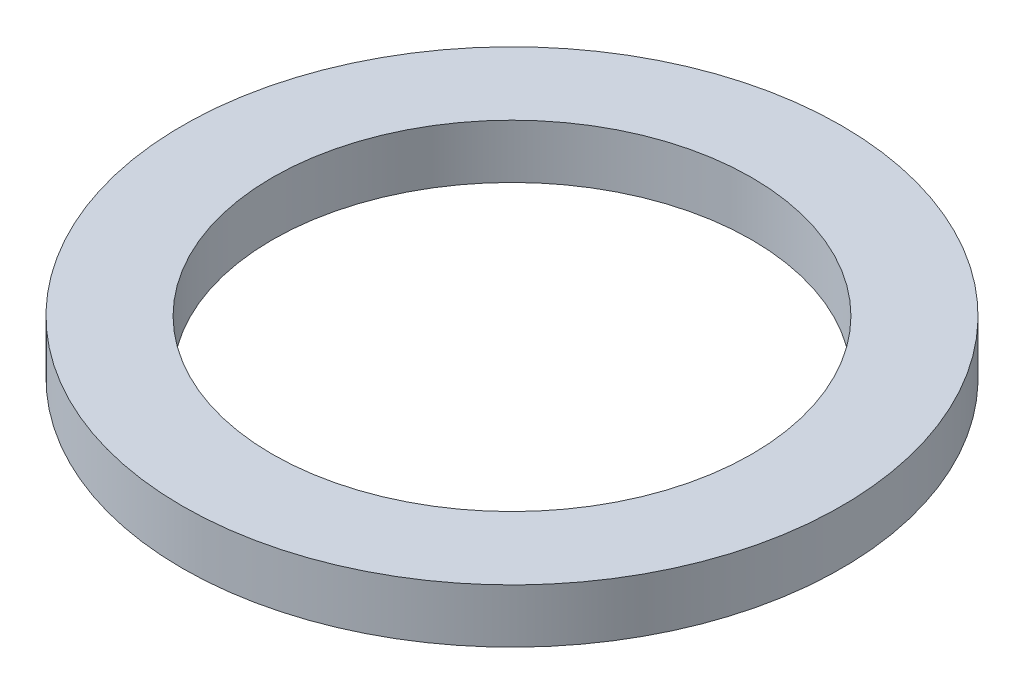
ISO-10303-21;
HEADER;
FILE_DESCRIPTION(('STEP AP214'),'2;1');
FILE_NAME('part.step','',(''),(''),'','','');
FILE_SCHEMA(('AUTOMOTIVE_DESIGN { 1 0 10303 214 1 1 1 1 }'));
ENDSEC;
DATA;
#1=APPLICATION_CONTEXT('core data for automotive mechanical design processes');
#2=APPLICATION_PROTOCOL_DEFINITION('international standard','automotive_design',2000,#1);
#3=PRODUCT_CONTEXT('',#1,'mechanical');
#4=PRODUCT('Part','Part','',(#3));
#5=PRODUCT_RELATED_PRODUCT_CATEGORY('part','',(#4));
#6=PRODUCT_DEFINITION_FORMATION('','',#4);
#7=PRODUCT_DEFINITION_CONTEXT('part definition',#1,'design');
#8=PRODUCT_DEFINITION('design','',#6,#7);
#9=PRODUCT_DEFINITION_SHAPE('','',#8);
#10=(LENGTH_UNIT() NAMED_UNIT(*) SI_UNIT(.MILLI.,.METRE.));
#11=(NAMED_UNIT(*) PLANE_ANGLE_UNIT() SI_UNIT($,.RADIAN.));
#12=(NAMED_UNIT(*) SI_UNIT($,.STERADIAN.) SOLID_ANGLE_UNIT());
#13=UNCERTAINTY_MEASURE_WITH_UNIT(LENGTH_MEASURE(1.E-05),#10,'distance_accuracy_value','');
#14=(GEOMETRIC_REPRESENTATION_CONTEXT(3) GLOBAL_UNCERTAINTY_ASSIGNED_CONTEXT((#13)) GLOBAL_UNIT_ASSIGNED_CONTEXT((#10,
#11,#12)) REPRESENTATION_CONTEXT('',''));
#15=CARTESIAN_POINT('',(0.,0.,0.));
#16=DIRECTION('',(0.,0.,1.));
#17=DIRECTION('',(1.,0.,0.));
#18=AXIS2_PLACEMENT_3D('',#15,#16,#17);
#19=CARTESIAN_POINT('',(0.,9.,0.));
#20=DIRECTION('',(0.,-1.,0.));
#21=DIRECTION('',(0.,0.,-1.));
#22=AXIS2_PLACEMENT_3D('',#19,#20,#21);
#23=CYLINDRICAL_SURFACE('',#22,55.);
#24=CARTESIAN_POINT('',(0.,9.,0.));
#25=DIRECTION('',(0.,1.,0.));
#26=DIRECTION('',(0.,0.,1.));
#27=AXIS2_PLACEMENT_3D('',#24,#25,#26);
#28=CIRCLE('',#27,55.);
#29=CARTESIAN_POINT('',(0.,9.,55.));
#30=VERTEX_POINT('',#29);
#31=EDGE_CURVE('E10',#30,#30,#28,.T.);
#32=ORIENTED_EDGE('',*,*,#31,.F.);
#33=EDGE_LOOP('',(#32));
#34=FACE_BOUND('',#33,.T.);
#35=CARTESIAN_POINT('',(0.,0.,0.));
#36=DIRECTION('',(0.,1.,0.));
#37=DIRECTION('',(0.,0.,1.));
#38=AXIS2_PLACEMENT_3D('',#35,#36,#37);
#39=CIRCLE('',#38,55.);
#40=CARTESIAN_POINT('',(0.,0.,55.));
#41=VERTEX_POINT('',#40);
#42=EDGE_CURVE('E37',#41,#41,#39,.T.);
#43=ORIENTED_EDGE('',*,*,#42,.T.);
#44=EDGE_LOOP('',(#43));
#45=FACE_BOUND('',#44,.T.);
#46=ADVANCED_FACE('F40',(#34,#45),#23,.T.);
#47=CARTESIAN_POINT('',(0.,9.,0.));
#48=DIRECTION('',(0.,1.,0.));
#49=DIRECTION('',(0.,0.,1.));
#50=AXIS2_PLACEMENT_3D('',#47,#48,#49);
#51=PLANE('',#50);
#52=CARTESIAN_POINT('',(0.,9.,0.));
#53=DIRECTION('',(0.,1.,0.));
#54=DIRECTION('',(0.,0.,1.));
#55=AXIS2_PLACEMENT_3D('',#52,#53,#54);
#56=CIRCLE('',#55,40.);
#57=CARTESIAN_POINT('',(0.,9.,40.));
#58=VERTEX_POINT('',#57);
#59=EDGE_CURVE('E50',#58,#58,#56,.T.);
#60=ORIENTED_EDGE('',*,*,#59,.F.);
#61=EDGE_LOOP('',(#60));
#62=FACE_BOUND('',#61,.T.);
#63=ORIENTED_EDGE('',*,*,#31,.T.);
#64=EDGE_LOOP('',(#63));
#65=FACE_BOUND('',#64,.T.);
#66=ADVANCED_FACE('F59',(#62,#65),#51,.T.);
#67=CARTESIAN_POINT('',(0.,0.,0.));
#68=DIRECTION('',(0.,1.,0.));
#69=DIRECTION('',(0.,0.,1.));
#70=AXIS2_PLACEMENT_3D('',#67,#68,#69);
#71=PLANE('',#70);
#72=CARTESIAN_POINT('',(0.,0.,0.));
#73=DIRECTION('',(0.,1.,0.));
#74=DIRECTION('',(0.,0.,1.));
#75=AXIS2_PLACEMENT_3D('',#72,#73,#74);
#76=CIRCLE('',#75,40.);
#77=CARTESIAN_POINT('',(0.,0.,40.));
#78=VERTEX_POINT('',#77);
#79=EDGE_CURVE('E47',#78,#78,#76,.T.);
#80=ORIENTED_EDGE('',*,*,#79,.T.);
#81=EDGE_LOOP('',(#80));
#82=FACE_BOUND('',#81,.T.);
#83=ORIENTED_EDGE('',*,*,#42,.F.);
#84=EDGE_LOOP('',(#83));
#85=FACE_BOUND('',#84,.T.);
#86=ADVANCED_FACE('F58',(#82,#85),#71,.F.);
#87=CARTESIAN_POINT('',(0.,9.,0.));
#88=DIRECTION('',(0.,-1.,0.));
#89=DIRECTION('',(0.,0.,-1.));
#90=AXIS2_PLACEMENT_3D('',#87,#88,#89);
#91=CYLINDRICAL_SURFACE('',#90,40.);
#92=ORIENTED_EDGE('',*,*,#59,.T.);
#93=EDGE_LOOP('',(#92));
#94=FACE_BOUND('',#93,.T.);
#95=ORIENTED_EDGE('',*,*,#79,.F.);
#96=EDGE_LOOP('',(#95));
#97=FACE_BOUND('',#96,.T.);
#98=ADVANCED_FACE('F54',(#94,#97),#91,.F.);
#99=CLOSED_SHELL('',(#46,#66,#86,#98));
#100=MANIFOLD_SOLID_BREP('B2',#99);
#101=ADVANCED_BREP_SHAPE_REPRESENTATION('',(#18,#100),#14);
#102=SHAPE_DEFINITION_REPRESENTATION(#9,#101);
ENDSEC;
END-ISO-10303-21;
